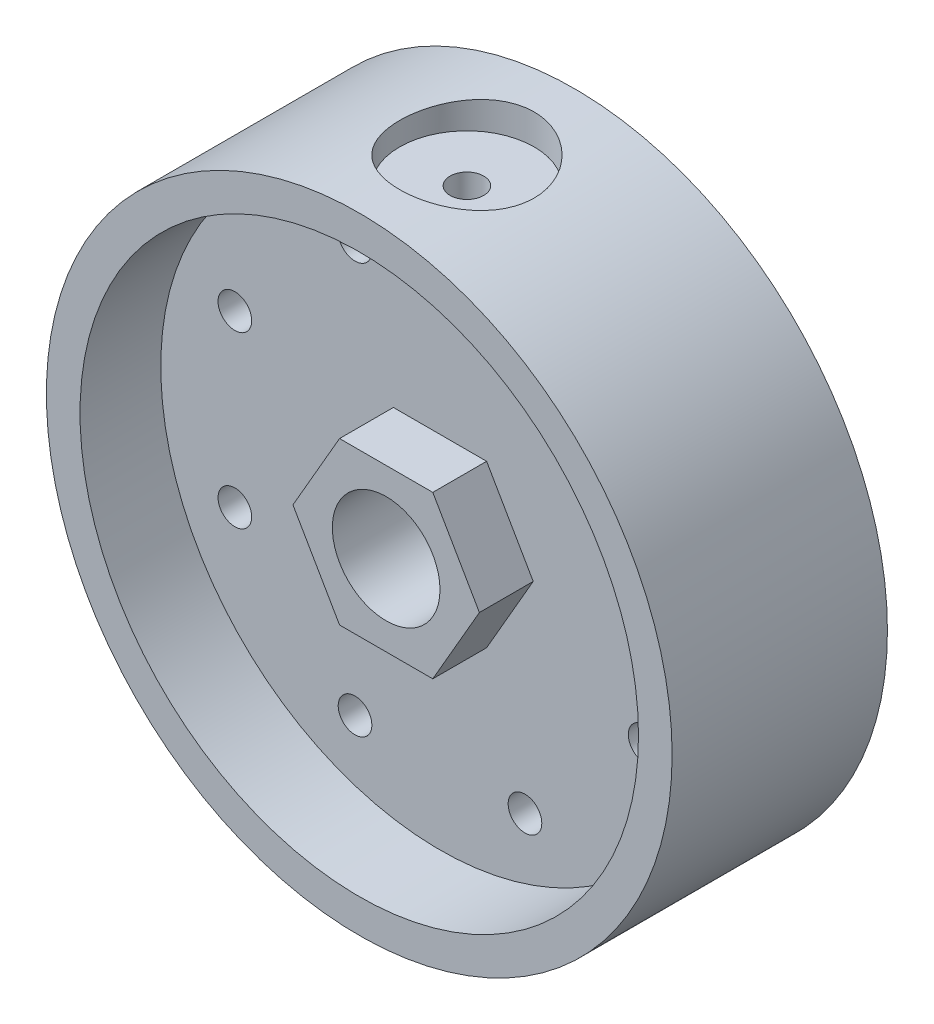
ISO-10303-21;
HEADER;
FILE_DESCRIPTION(('STEP AP214'),'2;1');
FILE_NAME('part.step','',(''),(''),'','','');
FILE_SCHEMA(('AUTOMOTIVE_DESIGN { 1 0 10303 214 1 1 1 1 }'));
ENDSEC;
DATA;
#1=APPLICATION_CONTEXT('core data for automotive mechanical design processes');
#2=APPLICATION_PROTOCOL_DEFINITION('international standard','automotive_design',2000,#1);
#3=PRODUCT_CONTEXT('',#1,'mechanical');
#4=PRODUCT('Part','Part','',(#3));
#5=PRODUCT_RELATED_PRODUCT_CATEGORY('part','',(#4));
#6=PRODUCT_DEFINITION_FORMATION('','',#4);
#7=PRODUCT_DEFINITION_CONTEXT('part definition',#1,'design');
#8=PRODUCT_DEFINITION('design','',#6,#7);
#9=PRODUCT_DEFINITION_SHAPE('','',#8);
#10=(LENGTH_UNIT() NAMED_UNIT(*) SI_UNIT(.MILLI.,.METRE.));
#11=(NAMED_UNIT(*) PLANE_ANGLE_UNIT() SI_UNIT($,.RADIAN.));
#12=(NAMED_UNIT(*) SI_UNIT($,.STERADIAN.) SOLID_ANGLE_UNIT());
#13=UNCERTAINTY_MEASURE_WITH_UNIT(LENGTH_MEASURE(1.E-05),#10,'distance_accuracy_value','');
#14=(GEOMETRIC_REPRESENTATION_CONTEXT(3) GLOBAL_UNCERTAINTY_ASSIGNED_CONTEXT((#13)) GLOBAL_UNIT_ASSIGNED_CONTEXT((#10,
#11,#12)) REPRESENTATION_CONTEXT('',''));
#15=CARTESIAN_POINT('',(0.,0.,0.));
#16=DIRECTION('',(0.,0.,1.));
#17=DIRECTION('',(1.,0.,0.));
#18=AXIS2_PLACEMENT_3D('',#15,#16,#17);
#19=CARTESIAN_POINT('',(0.,0.,8.));
#20=DIRECTION('',(0.,0.,-1.));
#21=DIRECTION('',(-1.,0.,0.));
#22=AXIS2_PLACEMENT_3D('',#19,#20,#21);
#23=CYLINDRICAL_SURFACE('',#22,23.25);
#24=CARTESIAN_POINT('',(0.,0.,-8.));
#25=DIRECTION('',(0.,0.,1.));
#26=DIRECTION('',(1.,0.,0.));
#27=AXIS2_PLACEMENT_3D('',#24,#25,#26);
#28=CIRCLE('',#27,23.25);
#29=CARTESIAN_POINT('',(23.25,0.,-8.));
#30=VERTEX_POINT('',#29);
#31=EDGE_CURVE('E122',#30,#30,#28,.T.);
#32=ORIENTED_EDGE('',*,*,#31,.T.);
#33=EDGE_LOOP('',(#32));
#34=FACE_BOUND('',#33,.T.);
#35=CARTESIAN_POINT('',(0.,0.,8.));
#36=DIRECTION('',(0.,0.,1.));
#37=DIRECTION('',(1.,0.,0.));
#38=AXIS2_PLACEMENT_3D('',#35,#36,#37);
#39=CIRCLE('',#38,23.25);
#40=CARTESIAN_POINT('',(23.25,0.,8.));
#41=VERTEX_POINT('',#40);
#42=EDGE_CURVE('E125',#41,#41,#39,.T.);
#43=ORIENTED_EDGE('',*,*,#42,.F.);
#44=EDGE_LOOP('',(#43));
#45=FACE_BOUND('',#44,.T.);
#46=CARTESIAN_POINT('',(0.,23.25,-5.));
#47=CARTESIAN_POINT('',(-0.277428962297859,23.2499948702913,-4.99999036768172));
#48=CARTESIAN_POINT('',(-0.554975379928546,23.2449838360012,-4.97683198256252));
#49=CARTESIAN_POINT('',(-1.10219239678642,23.2254776982743,-4.88490189615273));
#50=CARTESIAN_POINT('',(-1.37185709013371,23.2109756642638,-4.81609686199501));
#51=CARTESIAN_POINT('',(-1.89532244135633,23.1741031641389,-4.63512200176183));
#52=CARTESIAN_POINT('',(-2.14913908343721,23.1517407819554,-4.52299671645166));
#53=CARTESIAN_POINT('',(-2.63434678045265,23.1015646457361,-4.25870374465413));
#54=CARTESIAN_POINT('',(-2.86573856682339,23.0737510695925,-4.10653736479733));
#55=CARTESIAN_POINT('',(-3.30313494307527,23.0152390562648,-3.76397813617172));
#56=CARTESIAN_POINT('',(-3.50874106944982,22.9845058353873,-3.5730824057878));
#57=CARTESIAN_POINT('',(-3.88527564416666,22.9238650449716,-3.15956319904802));
#58=CARTESIAN_POINT('',(-4.05620108168123,22.8939575473136,-2.93693697084118));
#59=CARTESIAN_POINT('',(-4.36026781740796,22.838012186754,-2.46334633714929));
#60=CARTESIAN_POINT('',(-4.49298727048901,22.8120189338748,-2.21210534828567));
#61=CARTESIAN_POINT('',(-4.71416939687226,22.7673433500252,-1.69023575779506));
#62=CARTESIAN_POINT('',(-4.80263717302081,22.7486601761531,-1.41960939569306));
#63=CARTESIAN_POINT('',(-4.93149249119248,22.7210739264795,-0.870966519756432));
#64=CARTESIAN_POINT('',(-4.97258425004153,22.7120277605787,-0.593122746797123));
#65=CARTESIAN_POINT('',(-5.00771029908521,22.7043098362257,-0.0343489394789598));
#66=CARTESIAN_POINT('',(-5.0017501742957,22.7056368464867,0.246580724634423));
#67=CARTESIAN_POINT('',(-4.94350889212871,22.7183856962227,0.798333440001639));
#68=CARTESIAN_POINT('',(-4.892043603114,22.7296297232994,1.06924734092294));
#69=CARTESIAN_POINT('',(-4.74554451912709,22.760664794592,1.59850361961339));
#70=CARTESIAN_POINT('',(-4.65050835298066,22.7804563039678,1.85684531234289));
#71=CARTESIAN_POINT('',(-4.41881007356435,22.8265328860815,2.35592905727647));
#72=CARTESIAN_POINT('',(-4.28183229486579,22.8528669060609,2.5965198558037));
#73=CARTESIAN_POINT('',(-3.97036119622978,22.9090310288158,3.05160395578765));
#74=CARTESIAN_POINT('',(-3.79586292405064,22.9388615928552,3.26609380638398));
#75=CARTESIAN_POINT('',(-3.40997537731658,22.9994220826484,3.66758681821104));
#76=CARTESIAN_POINT('',(-3.19789181103427,23.030157780725,3.85392244140822));
#77=CARTESIAN_POINT('',(-2.74514086994692,23.0884974747145,4.18848780383638));
#78=CARTESIAN_POINT('',(-2.50447301037253,23.1161014174996,4.33671689667267));
#79=CARTESIAN_POINT('',(-2.00058525498588,23.1651523463971,4.59101799439453));
#80=CARTESIAN_POINT('',(-1.73732106818765,23.1865868647515,4.69700479595844));
#81=CARTESIAN_POINT('',(-1.19615725626832,23.2207908349017,4.86305299295469));
#82=CARTESIAN_POINT('',(-0.918259692829424,23.2335615038378,4.92312083945782));
#83=CARTESIAN_POINT('',(-0.361445668644593,23.2488263800472,4.99466034396225));
#84=CARTESIAN_POINT('',(-0.0826515417727663,23.2515134610579,5.00704419884536));
#85=CARTESIAN_POINT('',(0.47302183264907,23.2468479190746,4.98533344800251));
#86=CARTESIAN_POINT('',(0.749901204339466,23.2394959531988,4.95124188438242));
#87=CARTESIAN_POINT('',(1.29087921493399,23.2156999050576,4.83830476045499));
#88=CARTESIAN_POINT('',(1.55508193359298,23.1993526434246,4.75993554520831));
#89=CARTESIAN_POINT('',(2.06659299096856,23.1593948673067,4.56119479095134));
#90=CARTESIAN_POINT('',(2.31389992178722,23.1357837484367,4.44081975675824));
#91=CARTESIAN_POINT('',(2.78838649710608,23.0834404543401,4.15956906057808));
#92=CARTESIAN_POINT('',(3.01523939947769,23.0546417922087,3.99815481153425));
#93=CARTESIAN_POINT('',(3.43896614383763,22.9952575653828,3.64011926113557));
#94=CARTESIAN_POINT('',(3.63583622519762,22.9646717772008,3.44349355006287));
#95=CARTESIAN_POINT('',(3.99759808824279,22.9044975395541,3.01643712924636));
#96=CARTESIAN_POINT('',(4.16185926930961,22.874936480588,2.78546766990698));
#97=CARTESIAN_POINT('',(4.4492619206881,22.8207809545006,2.29868337547493));
#98=CARTESIAN_POINT('',(4.57240514867625,22.7961862750983,2.04286960301014));
#99=CARTESIAN_POINT('',(4.77325913813275,22.7549779093861,1.51501765096934));
#100=CARTESIAN_POINT('',(4.85122198489893,22.7383200340188,1.24307901170061));
#101=CARTESIAN_POINT('',(4.96024643532958,22.7147886321787,0.689558421167692));
#102=CARTESIAN_POINT('',(4.9913152527825,22.7079136008037,0.407977959938381));
#103=CARTESIAN_POINT('',(5.00537069532063,22.7048188727802,-0.150480745867452));
#104=CARTESIAN_POINT('',(4.98935643314884,22.7083777616307,-0.427333088453452));
#105=CARTESIAN_POINT('',(4.91192811423622,22.7252503601949,-0.974296074952696));
#106=CARTESIAN_POINT('',(4.8505145560264,22.7385639627918,-1.24440679286225));
#107=CARTESIAN_POINT('',(4.68450632201442,22.7733397258809,-1.76945742964018));
#108=CARTESIAN_POINT('',(4.58005242650581,22.7947753020539,-2.02444373682887));
#109=CARTESIAN_POINT('',(4.33105127589723,22.843391081748,-2.51342259096987));
#110=CARTESIAN_POINT('',(4.18650000516138,22.8705718605695,-2.74741303213922));
#111=CARTESIAN_POINT('',(3.85807353516054,22.9282801335397,-3.19269346680374));
#112=CARTESIAN_POINT('',(3.67348434315571,22.9588626984603,-3.40344980173078));
#113=CARTESIAN_POINT('',(3.27167445389198,23.0195536427537,-3.79132394643614));
#114=CARTESIAN_POINT('',(3.054446236119,23.0496619110706,-3.96843398225739));
#115=CARTESIAN_POINT('',(2.59026709005626,23.1064559757312,-4.28609348712874));
#116=CARTESIAN_POINT('',(2.34297979936272,23.1330944979172,-4.42616034893186));
#117=CARTESIAN_POINT('',(1.82785591431367,23.1794753930921,-4.66252105375056));
#118=CARTESIAN_POINT('',(1.56003704553169,23.1992236346963,-4.75885216871198));
#119=CARTESIAN_POINT('',(1.07656677844214,23.2260113490237,-4.88753455682198));
#120=CARTESIAN_POINT('',(0.863560203020742,23.2349520047982,-4.92962971802043));
#121=CARTESIAN_POINT('',(0.433726243381898,23.246948213214,-4.98586562393569));
#122=CARTESIAN_POINT('',(0.216899018374156,23.2500040104998,-5.00000753072196));
#123=CARTESIAN_POINT('',(0.,23.25,-5.));
#124=B_SPLINE_CURVE_WITH_KNOTS('',3,(#46,#47,#48,#49,#50,#51,#52,#53,#54,#55,#56,#57,#58,#59,
#60,#61,#62,#63,#64,#65,#66,#67,#68,#69,#70,#71,#72,#73,#74,#75,#76,#77,#78,#79,#80,#81,#82,#83,
#84,#85,#86,#87,#88,#89,#90,#91,#92,#93,#94,#95,#96,#97,#98,#99,#100,#101,#102,#103,#104,#105,
#106,#107,#108,#109,#110,#111,#112,#113,#114,#115,#116,#117,#118,#119,#120,#121,#122,#123),
.UNSPECIFIED.,.T.,.F.,(4,2,2,2,2,2,2,2,2,2,2,2,2,2,2,2,2,2,2,2,2,2,2,2,2,2,2,2,2,2,2,2,2,2,2,2,
2,2,4),(0.,0.831493043270543,1.66359394276181,2.49484156462187,3.32606206437389,
4.16885936273626,5.01172979784518,5.86357796809005,6.71532788549306,7.55424682366124,
8.39306618441069,9.21714446219887,10.0412675925421,10.8717524839221,11.7023470564088,
12.5502868109724,13.3982409480468,14.2478968690184,15.0974334014212,15.9306350928739,
16.7637822487005,17.5881324481783,18.4125512558161,19.2484047684037,20.084363032651,
20.9351801358292,21.7859608643194,22.6319477612816,23.4778045053694,24.3058424152785,
25.1338712326142,25.9592128897016,26.7846372322227,27.6262098435189,28.4679766637993,
29.320222981575,30.1717416387674,30.8218450790726,31.4719214927842),.UNSPECIFIED.);
#125=CARTESIAN_POINT('',(0.,23.25,-5.));
#126=VERTEX_POINT('',#125);
#127=EDGE_CURVE('E11',#126,#126,#124,.T.);
#128=ORIENTED_EDGE('',*,*,#127,.F.);
#129=EDGE_LOOP('',(#128));
#130=FACE_BOUND('',#129,.T.);
#131=ADVANCED_FACE('F35',(#34,#45,#130),#23,.T.);
#132=CARTESIAN_POINT('',(0.,23.25,0.));
#133=DIRECTION('',(0.,-1.,0.));
#134=DIRECTION('',(0.,0.,-1.));
#135=AXIS2_PLACEMENT_3D('',#132,#133,#134);
#136=CYLINDRICAL_SURFACE('',#135,1.25);
#137=CARTESIAN_POINT('',(0.,4.,-1.25));
#138=CARTESIAN_POINT('',(0.0684391851745465,3.99999965877989,-1.24999955341242));
#139=CARTESIAN_POINT('',(0.136883052502859,3.99822694984841,-1.24436077305555));
#140=CARTESIAN_POINT('',(0.271769209588448,3.99132894088807,-1.22201375846076));
#141=CARTESIAN_POINT('',(0.338211042725907,3.9862028819986,-1.20530301863564));
#142=CARTESIAN_POINT('',(0.467128543650807,3.97315815697909,-1.16143062880426));
#143=CARTESIAN_POINT('',(0.529610176985804,3.96524381499025,-1.13428515534703));
#144=CARTESIAN_POINT('',(0.64913480234646,3.94743969161093,-1.07038268232167));
#145=CARTESIAN_POINT('',(0.706176935444885,3.93754959899905,-1.03362416821941));
#146=CARTESIAN_POINT('',(0.814965334952281,3.91650213740282,-0.950344007982641));
#147=CARTESIAN_POINT('',(0.86652002815666,3.90531715926989,-0.903579114938928));
#148=CARTESIAN_POINT('',(0.961197382036994,3.88310046374208,-0.80213160758645));
#149=CARTESIAN_POINT('',(1.0043184728987,3.87206877523457,-0.747447522505453));
#150=CARTESIAN_POINT('',(1.08194336483114,3.85111144698172,-0.630055436191916));
#151=CARTESIAN_POINT('',(1.11620784150129,3.84121988301796,-0.567182522472778));
#152=CARTESIAN_POINT('',(1.17359741076672,3.82407801799234,-0.436207685018127));
#153=CARTESIAN_POINT('',(1.19672543771945,3.81682702128689,-0.368107144206068));
#154=CARTESIAN_POINT('',(1.23048459930033,3.80607606984501,-0.230771922547938));
#155=CARTESIAN_POINT('',(1.24147110007865,3.80246972929508,-0.161633156361147));
#156=CARTESIAN_POINT('',(1.25174555036988,3.7991005514095,-0.0224068810881062));
#157=CARTESIAN_POINT('',(1.25103660995772,3.79933669227334,0.0476803708216619));
#158=CARTESIAN_POINT('',(1.23821824732739,3.80353189075438,0.183874460268984));
#159=CARTESIAN_POINT('',(1.22656057869383,3.80734341745949,0.250029125861565));
#160=CARTESIAN_POINT('',(1.19290813355626,3.81802025652489,0.379392156537346));
#161=CARTESIAN_POINT('',(1.1709122584455,3.82488589343115,0.4426002077088));
#162=CARTESIAN_POINT('',(1.11688874681277,3.84101044014297,0.565351944432636));
#163=CARTESIAN_POINT('',(1.08471925662082,3.85030284660824,0.624828610691984));
#164=CARTESIAN_POINT('',(1.01136020737848,3.8702185658007,0.737687767879125));
#165=CARTESIAN_POINT('',(0.970168305215772,3.88084222394551,0.791068670253713));
#166=CARTESIAN_POINT('',(0.877716954182123,3.90281527800493,0.892774943416989));
#167=CARTESIAN_POINT('',(0.826084570592817,3.91417569605696,0.940759557779684));
#168=CARTESIAN_POINT('',(0.71536440809553,3.9359157075958,1.02747189357968));
#169=CARTESIAN_POINT('',(0.65627607734902,3.94629522838372,1.06619892921921));
#170=CARTESIAN_POINT('',(0.531664610465454,3.96501294890191,1.13352768860128));
#171=CARTESIAN_POINT('',(0.466094906919279,3.97333460648208,1.16204813546397));
#172=CARTESIAN_POINT('',(0.330767977782644,3.98687955828554,1.20755300085157));
#173=CARTESIAN_POINT('',(0.261012030724608,3.99210379325151,1.2245409222384));
#174=CARTESIAN_POINT('',(0.122185157290344,3.99871389395014,1.24591804257898));
#175=CARTESIAN_POINT('',(0.0531918487888419,4.00024022895439,1.25076854359352));
#176=CARTESIAN_POINT('',(-0.0846303057325852,3.99969799730981,1.24903377336267));
#177=CARTESIAN_POINT('',(-0.153459174306506,3.99762995581125,1.2424501726774));
#178=CARTESIAN_POINT('',(-0.287219332975852,3.99022363769772,1.21840440739361));
#179=CARTESIAN_POINT('',(-0.352204978420948,3.98496793110725,1.20121673238748));
#180=CARTESIAN_POINT('',(-0.478351928861365,3.97180121379252,1.15678564763331));
#181=CARTESIAN_POINT('',(-0.539512760449016,3.96388987514203,1.12954099597509));
#182=CARTESIAN_POINT('',(-0.657932406672232,3.94598542759568,1.06502678345121));
#183=CARTESIAN_POINT('',(-0.715059739787955,3.9359462681821,1.02752901250278));
#184=CARTESIAN_POINT('',(-0.822365850960095,3.91493410002887,0.943846789882984));
#185=CARTESIAN_POINT('',(-0.872542738043336,3.90396083845862,0.897659982256886));
#186=CARTESIAN_POINT('',(-0.966587462919657,3.88176994885247,0.795741109946314));
#187=CARTESIAN_POINT('',(-1.01012652339774,3.87055986714446,0.739703336254742));
#188=CARTESIAN_POINT('',(-1.08721250244909,3.84961947087602,0.620873383629261));
#189=CARTESIAN_POINT('',(-1.12075957972524,3.839889132814,0.558081311995568));
#190=CARTESIAN_POINT('',(-1.17670083481141,3.82311782360754,0.427654827114141));
#191=CARTESIAN_POINT('',(-1.19913819558886,3.81606646468027,0.360040350495301));
#192=CARTESIAN_POINT('',(-1.23222894320964,3.80551170941212,0.221727506676204));
#193=CARTESIAN_POINT('',(-1.2428868141461,3.80200696302675,0.151030323628686));
#194=CARTESIAN_POINT('',(-1.2517940615754,3.79908292712494,0.0119959124457574));
#195=CARTESIAN_POINT('',(-1.25058279621957,3.79948604683077,-0.056303453812931));
#196=CARTESIAN_POINT('',(-1.23708818129474,3.80390090472383,-0.19167458491918));
#197=CARTESIAN_POINT('',(-1.22480534822559,3.80791247457319,-0.258746406884));
#198=CARTESIAN_POINT('',(-1.18987729913378,3.81896814158112,-0.388794039601782));
#199=CARTESIAN_POINT('',(-1.16738642405944,3.82596698183474,-0.451815441096014));
#200=CARTESIAN_POINT('',(-1.11280227335064,3.84219704261348,-0.573240413531351));
#201=CARTESIAN_POINT('',(-1.08070704444254,3.85142871716522,-0.631643042077681));
#202=CARTESIAN_POINT('',(-1.00635675013475,3.8715348703158,-0.744645970440566));
#203=CARTESIAN_POINT('',(-0.963753335241274,3.88245948922441,-0.799008129500441));
#204=CARTESIAN_POINT('',(-0.870208996404848,3.90448998821726,-0.899986328111797));
#205=CARTESIAN_POINT('',(-0.819265842344402,3.91559591606795,-0.946600288991005));
#206=CARTESIAN_POINT('',(-0.708486662823332,3.93717271952329,-1.03228253836299));
#207=CARTESIAN_POINT('',(-0.64841457448738,3.94761101730634,-1.07105473644997));
#208=CARTESIAN_POINT('',(-0.522279138013654,3.96626769296916,-1.13789891513944));
#209=CARTESIAN_POINT('',(-0.456218157795449,3.97448694315832,-1.16597510214183));
#210=CARTESIAN_POINT('',(-0.325747635373977,3.98720650733461,-1.20859136760847));
#211=CARTESIAN_POINT('',(-0.261670337112545,3.99196240806139,-1.22407486730534));
#212=CARTESIAN_POINT('',(-0.131729895440247,3.99835900340486,-1.24477835996771));
#213=CARTESIAN_POINT('',(-0.0658671161396747,4.00000032839644,-1.250000429804));
#214=CARTESIAN_POINT('',(0.,4.,-1.25));
#215=B_SPLINE_CURVE_WITH_KNOTS('',3,(#137,#138,#139,#140,#141,#142,#143,#144,#145,#146,#147,
#148,#149,#150,#151,#152,#153,#154,#155,#156,#157,#158,#159,#160,#161,#162,#163,#164,#165,#166,
#167,#168,#169,#170,#171,#172,#173,#174,#175,#176,#177,#178,#179,#180,#181,#182,#183,#184,#185,
#186,#187,#188,#189,#190,#191,#192,#193,#194,#195,#196,#197,#198,#199,#200,#201,#202,#203,#204,
#205,#206,#207,#208,#209,#210,#211,#212,#213,#214),.UNSPECIFIED.,.T.,.F.,(4,2,2,2,2,2,2,2,2,2,2,
2,2,2,2,2,2,2,2,2,2,2,2,2,2,2,2,2,2,2,2,2,2,2,2,2,2,2,4),(0.,0.20507544943251,0.410197323349066,
0.615002479202436,0.819839921558391,1.03037822195158,1.24095567431276,1.45673771247494,
1.67246286279527,1.8816915016721,2.09086450295138,2.29176917422169,2.49269519979063,
2.69655642720545,2.90047066010359,3.113667472796,3.32688007413303,3.5417546068977,
3.75656384494554,3.96307568548237,4.16955735649363,4.37090626722872,4.572280050345,
4.77856324738343,4.98490245709259,5.1994177871314,5.41392970983712,5.62760115751031,
5.84119123892431,6.04512203476054,6.24904331751085,6.44997913396672,6.65095584330174,
6.85979514006362,7.06869037373341,7.28440668126413,7.50003806666338,7.69744636651541,
7.89481470763048),.UNSPECIFIED.);
#216=CARTESIAN_POINT('',(0.,4.,-1.25));
#217=VERTEX_POINT('',#216);
#218=EDGE_CURVE('E148',#217,#217,#215,.T.);
#219=ORIENTED_EDGE('',*,*,#218,.T.);
#220=EDGE_LOOP('',(#219));
#221=FACE_BOUND('',#220,.T.);
#222=CARTESIAN_POINT('',(0.,21.,0.));
#223=DIRECTION('',(0.,1.,0.));
#224=DIRECTION('',(0.,0.,1.));
#225=AXIS2_PLACEMENT_3D('',#222,#223,#224);
#226=CIRCLE('',#225,1.25);
#227=CARTESIAN_POINT('',(0.,21.,1.25));
#228=VERTEX_POINT('',#227);
#229=EDGE_CURVE('E156',#228,#228,#226,.T.);
#230=ORIENTED_EDGE('',*,*,#229,.T.);
#231=EDGE_LOOP('',(#230));
#232=FACE_BOUND('',#231,.T.);
#233=ADVANCED_FACE('F160',(#221,#232),#136,.F.);
#234=CARTESIAN_POINT('',(0.,0.,-6.));
#235=DIRECTION('',(0.,0.,1.));
#236=DIRECTION('',(1.,0.,0.));
#237=AXIS2_PLACEMENT_3D('',#234,#235,#236);
#238=CYLINDRICAL_SURFACE('',#237,4.);
#239=CARTESIAN_POINT('',(0.,0.,6.));
#240=DIRECTION('',(0.,0.,1.));
#241=DIRECTION('',(1.,0.,0.));
#242=AXIS2_PLACEMENT_3D('',#239,#240,#241);
#243=CIRCLE('',#242,4.);
#244=CARTESIAN_POINT('',(4.,0.,6.));
#245=VERTEX_POINT('',#244);
#246=EDGE_CURVE('E155',#245,#245,#243,.T.);
#247=ORIENTED_EDGE('',*,*,#246,.T.);
#248=EDGE_LOOP('',(#247));
#249=FACE_BOUND('',#248,.T.);
#250=CARTESIAN_POINT('',(0.,0.,-2.));
#251=DIRECTION('',(0.,0.,1.));
#252=DIRECTION('',(1.,0.,0.));
#253=AXIS2_PLACEMENT_3D('',#250,#251,#252);
#254=CIRCLE('',#253,4.);
#255=CARTESIAN_POINT('',(4.,0.,-2.));
#256=VERTEX_POINT('',#255);
#257=EDGE_CURVE('E107',#256,#256,#254,.T.);
#258=ORIENTED_EDGE('',*,*,#257,.F.);
#259=EDGE_LOOP('',(#258));
#260=FACE_BOUND('',#259,.T.);
#261=ORIENTED_EDGE('',*,*,#218,.F.);
#262=EDGE_LOOP('',(#261));
#263=FACE_BOUND('',#262,.T.);
#264=ADVANCED_FACE('F157',(#249,#260,#263),#238,.F.);
#265=CARTESIAN_POINT('',(0.,0.,2.));
#266=DIRECTION('',(0.,0.,1.));
#267=DIRECTION('',(1.,0.,0.));
#268=AXIS2_PLACEMENT_3D('',#265,#266,#267);
#269=PLANE('',#268);
#270=CARTESIAN_POINT('',(6.31427663402378,15.2440122864363,2.));
#271=DIRECTION('',(0.,0.,1.));
#272=DIRECTION('',(1.,0.,0.));
#273=AXIS2_PLACEMENT_3D('',#270,#271,#272);
#274=CIRCLE('',#273,1.25);
#275=CARTESIAN_POINT('',(7.56427663402378,15.2440122864363,2.));
#276=VERTEX_POINT('',#275);
#277=EDGE_CURVE('E183',#276,#276,#274,.T.);
#278=ORIENTED_EDGE('',*,*,#277,.F.);
#279=EDGE_LOOP('',(#278));
#280=FACE_BOUND('',#279,.T.);
#281=CARTESIAN_POINT('',(15.2440122864362,6.31427663402416,2.));
#282=DIRECTION('',(0.,0.,1.));
#283=DIRECTION('',(1.,0.,0.));
#284=AXIS2_PLACEMENT_3D('',#281,#282,#283);
#285=CIRCLE('',#284,1.25);
#286=CARTESIAN_POINT('',(16.4940122864362,6.31427663402416,2.));
#287=VERTEX_POINT('',#286);
#288=EDGE_CURVE('E201',#287,#287,#285,.T.);
#289=ORIENTED_EDGE('',*,*,#288,.F.);
#290=EDGE_LOOP('',(#289));
#291=FACE_BOUND('',#290,.T.);
#292=CARTESIAN_POINT('',(15.2440122864363,-6.31427663402384,2.));
#293=DIRECTION('',(0.,0.,1.));
#294=DIRECTION('',(1.,0.,0.));
#295=AXIS2_PLACEMENT_3D('',#292,#293,#294);
#296=CIRCLE('',#295,1.25);
#297=CARTESIAN_POINT('',(16.4940122864363,-6.31427663402384,2.));
#298=VERTEX_POINT('',#297);
#299=EDGE_CURVE('E198',#298,#298,#296,.T.);
#300=ORIENTED_EDGE('',*,*,#299,.F.);
#301=EDGE_LOOP('',(#300));
#302=FACE_BOUND('',#301,.T.);
#303=CARTESIAN_POINT('',(6.314276634024,-15.2440122864362,2.));
#304=DIRECTION('',(0.,0.,1.));
#305=DIRECTION('',(1.,0.,0.));
#306=AXIS2_PLACEMENT_3D('',#303,#304,#305);
#307=CIRCLE('',#306,1.25);
#308=CARTESIAN_POINT('',(7.564276634024,-15.2440122864362,2.));
#309=VERTEX_POINT('',#308);
#310=EDGE_CURVE('E195',#309,#309,#307,.T.);
#311=ORIENTED_EDGE('',*,*,#310,.F.);
#312=EDGE_LOOP('',(#311));
#313=FACE_BOUND('',#312,.T.);
#314=CARTESIAN_POINT('',(-6.31427663402389,-15.2440122864363,2.));
#315=DIRECTION('',(0.,0.,1.));
#316=DIRECTION('',(1.,0.,0.));
#317=AXIS2_PLACEMENT_3D('',#314,#315,#316);
#318=CIRCLE('',#317,1.25);
#319=CARTESIAN_POINT('',(-5.06427663402389,-15.2440122864363,2.));
#320=VERTEX_POINT('',#319);
#321=EDGE_CURVE('E191',#320,#320,#318,.T.);
#322=ORIENTED_EDGE('',*,*,#321,.F.);
#323=EDGE_LOOP('',(#322));
#324=FACE_BOUND('',#323,.T.);
#325=CARTESIAN_POINT('',(-15.2440122864362,-6.31427663402405,2.));
#326=DIRECTION('',(0.,0.,1.));
#327=DIRECTION('',(1.,0.,0.));
#328=AXIS2_PLACEMENT_3D('',#325,#326,#327);
#329=CIRCLE('',#328,1.25);
#330=CARTESIAN_POINT('',(-13.9940122864362,-6.31427663402405,2.));
#331=VERTEX_POINT('',#330);
#332=EDGE_CURVE('E187',#331,#331,#329,.T.);
#333=ORIENTED_EDGE('',*,*,#332,.F.);
#334=EDGE_LOOP('',(#333));
#335=FACE_BOUND('',#334,.T.);
#336=CARTESIAN_POINT('',(-15.2440122864363,6.31427663402394,2.));
#337=DIRECTION('',(0.,0.,1.));
#338=DIRECTION('',(1.,0.,0.));
#339=AXIS2_PLACEMENT_3D('',#336,#337,#338);
#340=CIRCLE('',#339,1.25);
#341=CARTESIAN_POINT('',(-13.9940122864363,6.31427663402394,2.));
#342=VERTEX_POINT('',#341);
#343=EDGE_CURVE('E179',#342,#342,#340,.T.);
#344=ORIENTED_EDGE('',*,*,#343,.F.);
#345=EDGE_LOOP('',(#344));
#346=FACE_BOUND('',#345,.T.);
#347=CARTESIAN_POINT('',(-6.314276634024,15.2440122864362,2.));
#348=DIRECTION('',(0.,0.,1.));
#349=DIRECTION('',(1.,0.,0.));
#350=AXIS2_PLACEMENT_3D('',#347,#348,#349);
#351=CIRCLE('',#350,1.25);
#352=CARTESIAN_POINT('',(-5.064276634024,15.2440122864362,2.));
#353=VERTEX_POINT('',#352);
#354=EDGE_CURVE('E178',#353,#353,#351,.T.);
#355=ORIENTED_EDGE('',*,*,#354,.F.);
#356=EDGE_LOOP('',(#355));
#357=FACE_BOUND('',#356,.T.);
#358=CARTESIAN_POINT('',(0.,0.,2.));
#359=DIRECTION('',(0.,0.,1.));
#360=DIRECTION('',(1.,0.,0.));
#361=AXIS2_PLACEMENT_3D('',#358,#359,#360);
#362=CIRCLE('',#361,20.75);
#363=CARTESIAN_POINT('',(20.75,0.,2.));
#364=VERTEX_POINT('',#363);
#365=EDGE_CURVE('E128',#364,#364,#362,.T.);
#366=ORIENTED_EDGE('',*,*,#365,.T.);
#367=EDGE_LOOP('',(#366));
#368=FACE_BOUND('',#367,.T.);
#369=DIRECTION('',(0.5,0.866025403784439,0.));
#370=VECTOR('',#369,1.);
#371=CARTESIAN_POINT('',(-5.19615242270663,3.,2.));
#372=LINE('',#371,#370);
#373=CARTESIAN_POINT('',(-6.92820323027551,0.,2.));
#374=VERTEX_POINT('',#373);
#375=CARTESIAN_POINT('',(-3.46410161513776,6.,2.));
#376=VERTEX_POINT('',#375);
#377=EDGE_CURVE('E145',#374,#376,#372,.T.);
#378=ORIENTED_EDGE('',*,*,#377,.T.);
#379=DIRECTION('',(1.,0.,0.));
#380=VECTOR('',#379,1.);
#381=CARTESIAN_POINT('',(0.,6.,2.));
#382=LINE('',#381,#380);
#383=CARTESIAN_POINT('',(3.46410161513776,6.,2.));
#384=VERTEX_POINT('',#383);
#385=EDGE_CURVE('E44',#376,#384,#382,.T.);
#386=ORIENTED_EDGE('',*,*,#385,.T.);
#387=DIRECTION('',(0.5,-0.866025403784439,0.));
#388=VECTOR('',#387,1.);
#389=CARTESIAN_POINT('',(5.19615242270663,3.,2.));
#390=LINE('',#389,#388);
#391=CARTESIAN_POINT('',(6.92820323027551,0.,2.));
#392=VERTEX_POINT('',#391);
#393=EDGE_CURVE('E133',#384,#392,#390,.T.);
#394=ORIENTED_EDGE('',*,*,#393,.T.);
#395=DIRECTION('',(-0.5,-0.866025403784439,0.));
#396=VECTOR('',#395,1.);
#397=CARTESIAN_POINT('',(5.19615242270663,-3.,2.));
#398=LINE('',#397,#396);
#399=CARTESIAN_POINT('',(3.46410161513776,-6.,2.));
#400=VERTEX_POINT('',#399);
#401=EDGE_CURVE('E136',#392,#400,#398,.T.);
#402=ORIENTED_EDGE('',*,*,#401,.T.);
#403=DIRECTION('',(-1.,0.,0.));
#404=VECTOR('',#403,1.);
#405=CARTESIAN_POINT('',(0.,-6.,2.));
#406=LINE('',#405,#404);
#407=CARTESIAN_POINT('',(-3.46410161513776,-6.,2.));
#408=VERTEX_POINT('',#407);
#409=EDGE_CURVE('E139',#400,#408,#406,.T.);
#410=ORIENTED_EDGE('',*,*,#409,.T.);
#411=DIRECTION('',(-0.5,0.866025403784439,0.));
#412=VECTOR('',#411,1.);
#413=CARTESIAN_POINT('',(-5.19615242270663,-3.,2.));
#414=LINE('',#413,#412);
#415=EDGE_CURVE('E142',#408,#374,#414,.T.);
#416=ORIENTED_EDGE('',*,*,#415,.T.);
#417=EDGE_LOOP('',(#378,#386,#394,#402,#410,#416));
#418=FACE_BOUND('',#417,.T.);
#419=ADVANCED_FACE('F245',(#280,#291,#302,#313,#324,#335,#346,#357,#368,#418),#269,.T.);
#420=CARTESIAN_POINT('',(0.,0.,8.));
#421=DIRECTION('',(0.,0.,-1.));
#422=DIRECTION('',(-1.,0.,0.));
#423=AXIS2_PLACEMENT_3D('',#420,#421,#422);
#424=CYLINDRICAL_SURFACE('',#423,20.75);
#425=CARTESIAN_POINT('',(0.,0.,-8.));
#426=DIRECTION('',(0.,0.,1.));
#427=DIRECTION('',(1.,0.,0.));
#428=AXIS2_PLACEMENT_3D('',#425,#426,#427);
#429=CIRCLE('',#428,20.75);
#430=CARTESIAN_POINT('',(20.75,0.,-8.));
#431=VERTEX_POINT('',#430);
#432=EDGE_CURVE('E113',#431,#431,#429,.T.);
#433=ORIENTED_EDGE('',*,*,#432,.F.);
#434=EDGE_LOOP('',(#433));
#435=FACE_BOUND('',#434,.T.);
#436=CARTESIAN_POINT('',(0.,0.,-2.));
#437=DIRECTION('',(0.,0.,1.));
#438=DIRECTION('',(1.,0.,0.));
#439=AXIS2_PLACEMENT_3D('',#436,#437,#438);
#440=CIRCLE('',#439,20.75);
#441=CARTESIAN_POINT('',(20.75,0.,-2.));
#442=VERTEX_POINT('',#441);
#443=EDGE_CURVE('E110',#442,#442,#440,.T.);
#444=ORIENTED_EDGE('',*,*,#443,.T.);
#445=EDGE_LOOP('',(#444));
#446=FACE_BOUND('',#445,.T.);
#447=ADVANCED_FACE('F273',(#435,#446),#424,.F.);
#448=CARTESIAN_POINT('',(0.,0.,8.));
#449=DIRECTION('',(0.,0.,1.));
#450=DIRECTION('',(1.,0.,0.));
#451=AXIS2_PLACEMENT_3D('',#448,#449,#450);
#452=PLANE('',#451);
#453=ORIENTED_EDGE('',*,*,#42,.T.);
#454=EDGE_LOOP('',(#453));
#455=FACE_BOUND('',#454,.T.);
#456=CARTESIAN_POINT('',(0.,0.,8.));
#457=DIRECTION('',(0.,0.,1.));
#458=DIRECTION('',(1.,0.,0.));
#459=AXIS2_PLACEMENT_3D('',#456,#457,#458);
#460=CIRCLE('',#459,20.75);
#461=CARTESIAN_POINT('',(20.75,0.,8.));
#462=VERTEX_POINT('',#461);
#463=EDGE_CURVE('E119',#462,#462,#460,.T.);
#464=ORIENTED_EDGE('',*,*,#463,.F.);
#465=EDGE_LOOP('',(#464));
#466=FACE_BOUND('',#465,.T.);
#467=ADVANCED_FACE('F269',(#455,#466),#452,.T.);
#468=CARTESIAN_POINT('',(0.,0.,-8.));
#469=DIRECTION('',(0.,0.,1.));
#470=DIRECTION('',(1.,0.,0.));
#471=AXIS2_PLACEMENT_3D('',#468,#469,#470);
#472=PLANE('',#471);
#473=ORIENTED_EDGE('',*,*,#31,.F.);
#474=EDGE_LOOP('',(#473));
#475=FACE_BOUND('',#474,.T.);
#476=ORIENTED_EDGE('',*,*,#432,.T.);
#477=EDGE_LOOP('',(#476));
#478=FACE_BOUND('',#477,.T.);
#479=ADVANCED_FACE('F272',(#475,#478),#472,.F.);
#480=ORIENTED_EDGE('',*,*,#365,.F.);
#481=EDGE_LOOP('',(#480));
#482=FACE_BOUND('',#481,.T.);
#483=ORIENTED_EDGE('',*,*,#463,.T.);
#484=EDGE_LOOP('',(#483));
#485=FACE_BOUND('',#484,.T.);
#486=ADVANCED_FACE('F277',(#482,#485),#424,.F.);
#487=CARTESIAN_POINT('',(0.,0.,-2.));
#488=DIRECTION('',(0.,0.,1.));
#489=DIRECTION('',(1.,0.,0.));
#490=AXIS2_PLACEMENT_3D('',#487,#488,#489);
#491=PLANE('',#490);
#492=CARTESIAN_POINT('',(6.31427663402378,15.2440122864363,-2.));
#493=DIRECTION('',(0.,0.,1.));
#494=DIRECTION('',(1.,0.,0.));
#495=AXIS2_PLACEMENT_3D('',#492,#493,#494);
#496=CIRCLE('',#495,1.25);
#497=CARTESIAN_POINT('',(7.56427663402378,15.2440122864363,-2.));
#498=VERTEX_POINT('',#497);
#499=EDGE_CURVE('E39',#498,#498,#496,.T.);
#500=ORIENTED_EDGE('',*,*,#499,.T.);
#501=EDGE_LOOP('',(#500));
#502=FACE_BOUND('',#501,.T.);
#503=CARTESIAN_POINT('',(15.2440122864362,6.31427663402416,-2.));
#504=DIRECTION('',(0.,0.,1.));
#505=DIRECTION('',(1.,0.,0.));
#506=AXIS2_PLACEMENT_3D('',#503,#504,#505);
#507=CIRCLE('',#506,1.25);
#508=CARTESIAN_POINT('',(16.4940122864362,6.31427663402416,-2.));
#509=VERTEX_POINT('',#508);
#510=EDGE_CURVE('E199',#509,#509,#507,.T.);
#511=ORIENTED_EDGE('',*,*,#510,.T.);
#512=EDGE_LOOP('',(#511));
#513=FACE_BOUND('',#512,.T.);
#514=CARTESIAN_POINT('',(15.2440122864363,-6.31427663402384,-2.));
#515=DIRECTION('',(0.,0.,1.));
#516=DIRECTION('',(1.,0.,0.));
#517=AXIS2_PLACEMENT_3D('',#514,#515,#516);
#518=CIRCLE('',#517,1.25);
#519=CARTESIAN_POINT('',(16.4940122864363,-6.31427663402384,-2.));
#520=VERTEX_POINT('',#519);
#521=EDGE_CURVE('E196',#520,#520,#518,.T.);
#522=ORIENTED_EDGE('',*,*,#521,.T.);
#523=EDGE_LOOP('',(#522));
#524=FACE_BOUND('',#523,.T.);
#525=CARTESIAN_POINT('',(6.314276634024,-15.2440122864362,-2.));
#526=DIRECTION('',(0.,0.,1.));
#527=DIRECTION('',(1.,0.,0.));
#528=AXIS2_PLACEMENT_3D('',#525,#526,#527);
#529=CIRCLE('',#528,1.25);
#530=CARTESIAN_POINT('',(7.564276634024,-15.2440122864362,-2.));
#531=VERTEX_POINT('',#530);
#532=EDGE_CURVE('E192',#531,#531,#529,.T.);
#533=ORIENTED_EDGE('',*,*,#532,.T.);
#534=EDGE_LOOP('',(#533));
#535=FACE_BOUND('',#534,.T.);
#536=CARTESIAN_POINT('',(-6.31427663402389,-15.2440122864363,-2.));
#537=DIRECTION('',(0.,0.,1.));
#538=DIRECTION('',(1.,0.,0.));
#539=AXIS2_PLACEMENT_3D('',#536,#537,#538);
#540=CIRCLE('',#539,1.25);
#541=CARTESIAN_POINT('',(-5.06427663402389,-15.2440122864363,-2.));
#542=VERTEX_POINT('',#541);
#543=EDGE_CURVE('E188',#542,#542,#540,.T.);
#544=ORIENTED_EDGE('',*,*,#543,.T.);
#545=EDGE_LOOP('',(#544));
#546=FACE_BOUND('',#545,.T.);
#547=CARTESIAN_POINT('',(-15.2440122864362,-6.31427663402405,-2.));
#548=DIRECTION('',(0.,0.,1.));
#549=DIRECTION('',(1.,0.,0.));
#550=AXIS2_PLACEMENT_3D('',#547,#548,#549);
#551=CIRCLE('',#550,1.25);
#552=CARTESIAN_POINT('',(-13.9940122864362,-6.31427663402405,-2.));
#553=VERTEX_POINT('',#552);
#554=EDGE_CURVE('E184',#553,#553,#551,.T.);
#555=ORIENTED_EDGE('',*,*,#554,.T.);
#556=EDGE_LOOP('',(#555));
#557=FACE_BOUND('',#556,.T.);
#558=CARTESIAN_POINT('',(-15.2440122864363,6.31427663402394,-2.));
#559=DIRECTION('',(0.,0.,1.));
#560=DIRECTION('',(1.,0.,0.));
#561=AXIS2_PLACEMENT_3D('',#558,#559,#560);
#562=CIRCLE('',#561,1.25);
#563=CARTESIAN_POINT('',(-13.9940122864363,6.31427663402394,-2.));
#564=VERTEX_POINT('',#563);
#565=EDGE_CURVE('E180',#564,#564,#562,.T.);
#566=ORIENTED_EDGE('',*,*,#565,.T.);
#567=EDGE_LOOP('',(#566));
#568=FACE_BOUND('',#567,.T.);
#569=CARTESIAN_POINT('',(-6.314276634024,15.2440122864362,-2.));
#570=DIRECTION('',(0.,0.,1.));
#571=DIRECTION('',(1.,0.,0.));
#572=AXIS2_PLACEMENT_3D('',#569,#570,#571);
#573=CIRCLE('',#572,1.25);
#574=CARTESIAN_POINT('',(-5.064276634024,15.2440122864362,-2.));
#575=VERTEX_POINT('',#574);
#576=EDGE_CURVE('E175',#575,#575,#573,.T.);
#577=ORIENTED_EDGE('',*,*,#576,.T.);
#578=EDGE_LOOP('',(#577));
#579=FACE_BOUND('',#578,.T.);
#580=ORIENTED_EDGE('',*,*,#257,.T.);
#581=EDGE_LOOP('',(#580));
#582=FACE_BOUND('',#581,.T.);
#583=ORIENTED_EDGE('',*,*,#443,.F.);
#584=EDGE_LOOP('',(#583));
#585=FACE_BOUND('',#584,.T.);
#586=ADVANCED_FACE('F279',(#502,#513,#524,#535,#546,#557,#568,#579,#582,#585),#491,.F.);
#587=CARTESIAN_POINT('',(3.46410161513776,6.,6.));
#588=DIRECTION('',(0.,-1.,0.));
#589=DIRECTION('',(0.,0.,-1.));
#590=AXIS2_PLACEMENT_3D('',#587,#588,#589);
#591=PLANE('',#590);
#592=ORIENTED_EDGE('',*,*,#385,.F.);
#593=DIRECTION('',(0.,0.,-1.));
#594=VECTOR('',#593,1.);
#595=CARTESIAN_POINT('',(-3.46410161513776,6.,6.));
#596=LINE('',#595,#594);
#597=CARTESIAN_POINT('',(-3.46410161513776,6.,6.));
#598=VERTEX_POINT('',#597);
#599=EDGE_CURVE('E94',#598,#376,#596,.T.);
#600=ORIENTED_EDGE('',*,*,#599,.F.);
#601=DIRECTION('',(-1.,0.,0.));
#602=VECTOR('',#601,1.);
#603=CARTESIAN_POINT('',(3.46410161513776,6.,6.));
#604=LINE('',#603,#602);
#605=CARTESIAN_POINT('',(3.46410161513776,6.,6.));
#606=VERTEX_POINT('',#605);
#607=EDGE_CURVE('E101',#606,#598,#604,.T.);
#608=ORIENTED_EDGE('',*,*,#607,.F.);
#609=DIRECTION('',(0.,0.,-1.));
#610=VECTOR('',#609,1.);
#611=CARTESIAN_POINT('',(3.46410161513776,6.,6.));
#612=LINE('',#611,#610);
#613=EDGE_CURVE('E232',#606,#384,#612,.T.);
#614=ORIENTED_EDGE('',*,*,#613,.T.);
#615=EDGE_LOOP('',(#592,#600,#608,#614));
#616=FACE_BOUND('',#615,.T.);
#617=ADVANCED_FACE('F109',(#616),#591,.F.);
#618=CARTESIAN_POINT('',(-3.46410161513776,6.,6.));
#619=DIRECTION('',(0.866025403784439,-0.5,0.));
#620=DIRECTION('',(0.5,0.866025403784439,0.));
#621=AXIS2_PLACEMENT_3D('',#618,#619,#620);
#622=PLANE('',#621);
#623=ORIENTED_EDGE('',*,*,#377,.F.);
#624=DIRECTION('',(0.,0.,-1.));
#625=VECTOR('',#624,1.);
#626=CARTESIAN_POINT('',(-6.92820323027551,0.,6.));
#627=LINE('',#626,#625);
#628=CARTESIAN_POINT('',(-6.92820323027551,0.,6.));
#629=VERTEX_POINT('',#628);
#630=EDGE_CURVE('E97',#629,#374,#627,.T.);
#631=ORIENTED_EDGE('',*,*,#630,.F.);
#632=DIRECTION('',(-0.5,-0.866025403784439,0.));
#633=VECTOR('',#632,1.);
#634=CARTESIAN_POINT('',(-3.46410161513776,6.,6.));
#635=LINE('',#634,#633);
#636=EDGE_CURVE('E91',#598,#629,#635,.T.);
#637=ORIENTED_EDGE('',*,*,#636,.F.);
#638=ORIENTED_EDGE('',*,*,#599,.T.);
#639=EDGE_LOOP('',(#623,#631,#637,#638));
#640=FACE_BOUND('',#639,.T.);
#641=ADVANCED_FACE('F93',(#640),#622,.F.);
#642=CARTESIAN_POINT('',(-6.92820323027551,0.,6.));
#643=DIRECTION('',(0.866025403784439,0.5,0.));
#644=DIRECTION('',(-0.5,0.866025403784439,0.));
#645=AXIS2_PLACEMENT_3D('',#642,#643,#644);
#646=PLANE('',#645);
#647=ORIENTED_EDGE('',*,*,#415,.F.);
#648=DIRECTION('',(0.,0.,-1.));
#649=VECTOR('',#648,1.);
#650=CARTESIAN_POINT('',(-3.46410161513776,-6.,6.));
#651=LINE('',#650,#649);
#652=CARTESIAN_POINT('',(-3.46410161513776,-6.,6.));
#653=VERTEX_POINT('',#652);
#654=EDGE_CURVE('E115',#653,#408,#651,.T.);
#655=ORIENTED_EDGE('',*,*,#654,.F.);
#656=DIRECTION('',(0.5,-0.866025403784439,0.));
#657=VECTOR('',#656,1.);
#658=CARTESIAN_POINT('',(-6.92820323027551,0.,6.));
#659=LINE('',#658,#657);
#660=EDGE_CURVE('E100',#629,#653,#659,.T.);
#661=ORIENTED_EDGE('',*,*,#660,.F.);
#662=ORIENTED_EDGE('',*,*,#630,.T.);
#663=EDGE_LOOP('',(#647,#655,#661,#662));
#664=FACE_BOUND('',#663,.T.);
#665=ADVANCED_FACE('F249',(#664),#646,.F.);
#666=CARTESIAN_POINT('',(-3.46410161513776,-6.,6.));
#667=DIRECTION('',(0.,1.,0.));
#668=DIRECTION('',(0.,0.,1.));
#669=AXIS2_PLACEMENT_3D('',#666,#667,#668);
#670=PLANE('',#669);
#671=ORIENTED_EDGE('',*,*,#409,.F.);
#672=DIRECTION('',(0.,0.,-1.));
#673=VECTOR('',#672,1.);
#674=CARTESIAN_POINT('',(3.46410161513776,-6.,6.));
#675=LINE('',#674,#673);
#676=CARTESIAN_POINT('',(3.46410161513776,-6.,6.));
#677=VERTEX_POINT('',#676);
#678=EDGE_CURVE('E235',#677,#400,#675,.T.);
#679=ORIENTED_EDGE('',*,*,#678,.F.);
#680=DIRECTION('',(1.,0.,0.));
#681=VECTOR('',#680,1.);
#682=CARTESIAN_POINT('',(-3.46410161513776,-6.,6.));
#683=LINE('',#682,#681);
#684=EDGE_CURVE('E227',#653,#677,#683,.T.);
#685=ORIENTED_EDGE('',*,*,#684,.F.);
#686=ORIENTED_EDGE('',*,*,#654,.T.);
#687=EDGE_LOOP('',(#671,#679,#685,#686));
#688=FACE_BOUND('',#687,.T.);
#689=ADVANCED_FACE('F241',(#688),#670,.F.);
#690=CARTESIAN_POINT('',(3.46410161513776,-6.,6.));
#691=DIRECTION('',(-0.866025403784438,0.5,0.));
#692=DIRECTION('',(-0.5,-0.866025403784439,0.));
#693=AXIS2_PLACEMENT_3D('',#690,#691,#692);
#694=PLANE('',#693);
#695=ORIENTED_EDGE('',*,*,#401,.F.);
#696=DIRECTION('',(0.,0.,-1.));
#697=VECTOR('',#696,1.);
#698=CARTESIAN_POINT('',(6.92820323027551,0.,6.));
#699=LINE('',#698,#697);
#700=CARTESIAN_POINT('',(6.92820323027551,0.,6.));
#701=VERTEX_POINT('',#700);
#702=EDGE_CURVE('E52',#701,#392,#699,.T.);
#703=ORIENTED_EDGE('',*,*,#702,.F.);
#704=DIRECTION('',(0.5,0.866025403784439,0.));
#705=VECTOR('',#704,1.);
#706=CARTESIAN_POINT('',(3.46410161513776,-6.,6.));
#707=LINE('',#706,#705);
#708=EDGE_CURVE('E229',#677,#701,#707,.T.);
#709=ORIENTED_EDGE('',*,*,#708,.F.);
#710=ORIENTED_EDGE('',*,*,#678,.T.);
#711=EDGE_LOOP('',(#695,#703,#709,#710));
#712=FACE_BOUND('',#711,.T.);
#713=ADVANCED_FACE('F247',(#712),#694,.F.);
#714=CARTESIAN_POINT('',(6.92820323027551,0.,6.));
#715=DIRECTION('',(-0.866025403784439,-0.5,0.));
#716=DIRECTION('',(0.5,-0.866025403784439,0.));
#717=AXIS2_PLACEMENT_3D('',#714,#715,#716);
#718=PLANE('',#717);
#719=ORIENTED_EDGE('',*,*,#393,.F.);
#720=ORIENTED_EDGE('',*,*,#613,.F.);
#721=DIRECTION('',(-0.5,0.866025403784439,0.));
#722=VECTOR('',#721,1.);
#723=CARTESIAN_POINT('',(6.92820323027551,0.,6.));
#724=LINE('',#723,#722);
#725=EDGE_CURVE('E105',#701,#606,#724,.T.);
#726=ORIENTED_EDGE('',*,*,#725,.F.);
#727=ORIENTED_EDGE('',*,*,#702,.T.);
#728=EDGE_LOOP('',(#719,#720,#726,#727));
#729=FACE_BOUND('',#728,.T.);
#730=ADVANCED_FACE('F337',(#729),#718,.F.);
#731=CARTESIAN_POINT('',(0.,0.,6.));
#732=DIRECTION('',(0.,0.,1.));
#733=DIRECTION('',(1.,0.,0.));
#734=AXIS2_PLACEMENT_3D('',#731,#732,#733);
#735=PLANE('',#734);
#736=ORIENTED_EDGE('',*,*,#246,.F.);
#737=EDGE_LOOP('',(#736));
#738=FACE_BOUND('',#737,.T.);
#739=ORIENTED_EDGE('',*,*,#607,.T.);
#740=ORIENTED_EDGE('',*,*,#636,.T.);
#741=ORIENTED_EDGE('',*,*,#660,.T.);
#742=ORIENTED_EDGE('',*,*,#684,.T.);
#743=ORIENTED_EDGE('',*,*,#708,.T.);
#744=ORIENTED_EDGE('',*,*,#725,.T.);
#745=EDGE_LOOP('',(#739,#740,#741,#742,#743,#744));
#746=FACE_BOUND('',#745,.T.);
#747=ADVANCED_FACE('F104',(#738,#746),#735,.T.);
#748=CARTESIAN_POINT('',(0.,23.25,0.));
#749=DIRECTION('',(0.,-1.,0.));
#750=DIRECTION('',(0.,0.,-1.));
#751=AXIS2_PLACEMENT_3D('',#748,#749,#750);
#752=CYLINDRICAL_SURFACE('',#751,5.);
#753=CARTESIAN_POINT('',(0.,21.,0.));
#754=DIRECTION('',(0.,1.,0.));
#755=DIRECTION('',(0.,0.,1.));
#756=AXIS2_PLACEMENT_3D('',#753,#754,#755);
#757=CIRCLE('',#756,5.);
#758=CARTESIAN_POINT('',(0.,21.,5.));
#759=VERTEX_POINT('',#758);
#760=EDGE_CURVE('E219',#759,#759,#757,.T.);
#761=ORIENTED_EDGE('',*,*,#760,.F.);
#762=EDGE_LOOP('',(#761));
#763=FACE_BOUND('',#762,.T.);
#764=ORIENTED_EDGE('',*,*,#127,.T.);
#765=EDGE_LOOP('',(#764));
#766=FACE_BOUND('',#765,.T.);
#767=ADVANCED_FACE('F165',(#763,#766),#752,.F.);
#768=CARTESIAN_POINT('',(0.,21.,0.));
#769=DIRECTION('',(0.,1.,0.));
#770=DIRECTION('',(0.,0.,1.));
#771=AXIS2_PLACEMENT_3D('',#768,#769,#770);
#772=PLANE('',#771);
#773=ORIENTED_EDGE('',*,*,#229,.F.);
#774=EDGE_LOOP('',(#773));
#775=FACE_BOUND('',#774,.T.);
#776=ORIENTED_EDGE('',*,*,#760,.T.);
#777=EDGE_LOOP('',(#776));
#778=FACE_BOUND('',#777,.T.);
#779=ADVANCED_FACE('F169',(#775,#778),#772,.T.);
#780=CARTESIAN_POINT('',(-6.314276634024,15.2440122864362,-8.));
#781=DIRECTION('',(0.,0.,1.));
#782=DIRECTION('',(1.,0.,0.));
#783=AXIS2_PLACEMENT_3D('',#780,#781,#782);
#784=CYLINDRICAL_SURFACE('',#783,1.25);
#785=ORIENTED_EDGE('',*,*,#354,.T.);
#786=EDGE_LOOP('',(#785));
#787=FACE_BOUND('',#786,.T.);
#788=ORIENTED_EDGE('',*,*,#576,.F.);
#789=EDGE_LOOP('',(#788));
#790=FACE_BOUND('',#789,.T.);
#791=ADVANCED_FACE('F384',(#787,#790),#784,.F.);
#792=CARTESIAN_POINT('',(-15.2440122864363,6.31427663402394,-8.));
#793=DIRECTION('',(0.,0.,1.));
#794=DIRECTION('',(1.,0.,0.));
#795=AXIS2_PLACEMENT_3D('',#792,#793,#794);
#796=CYLINDRICAL_SURFACE('',#795,1.25);
#797=ORIENTED_EDGE('',*,*,#343,.T.);
#798=EDGE_LOOP('',(#797));
#799=FACE_BOUND('',#798,.T.);
#800=ORIENTED_EDGE('',*,*,#565,.F.);
#801=EDGE_LOOP('',(#800));
#802=FACE_BOUND('',#801,.T.);
#803=ADVANCED_FACE('F392',(#799,#802),#796,.F.);
#804=CARTESIAN_POINT('',(-15.2440122864362,-6.31427663402405,-8.));
#805=DIRECTION('',(0.,0.,1.));
#806=DIRECTION('',(1.,0.,0.));
#807=AXIS2_PLACEMENT_3D('',#804,#805,#806);
#808=CYLINDRICAL_SURFACE('',#807,1.25);
#809=ORIENTED_EDGE('',*,*,#332,.T.);
#810=EDGE_LOOP('',(#809));
#811=FACE_BOUND('',#810,.T.);
#812=ORIENTED_EDGE('',*,*,#554,.F.);
#813=EDGE_LOOP('',(#812));
#814=FACE_BOUND('',#813,.T.);
#815=ADVANCED_FACE('F411',(#811,#814),#808,.F.);
#816=CARTESIAN_POINT('',(-6.31427663402389,-15.2440122864363,-8.));
#817=DIRECTION('',(0.,0.,1.));
#818=DIRECTION('',(1.,0.,0.));
#819=AXIS2_PLACEMENT_3D('',#816,#817,#818);
#820=CYLINDRICAL_SURFACE('',#819,1.25);
#821=ORIENTED_EDGE('',*,*,#321,.T.);
#822=EDGE_LOOP('',(#821));
#823=FACE_BOUND('',#822,.T.);
#824=ORIENTED_EDGE('',*,*,#543,.F.);
#825=EDGE_LOOP('',(#824));
#826=FACE_BOUND('',#825,.T.);
#827=ADVANCED_FACE('F421',(#823,#826),#820,.F.);
#828=CARTESIAN_POINT('',(6.314276634024,-15.2440122864362,-8.));
#829=DIRECTION('',(0.,0.,1.));
#830=DIRECTION('',(1.,0.,0.));
#831=AXIS2_PLACEMENT_3D('',#828,#829,#830);
#832=CYLINDRICAL_SURFACE('',#831,1.25);
#833=ORIENTED_EDGE('',*,*,#310,.T.);
#834=EDGE_LOOP('',(#833));
#835=FACE_BOUND('',#834,.T.);
#836=ORIENTED_EDGE('',*,*,#532,.F.);
#837=EDGE_LOOP('',(#836));
#838=FACE_BOUND('',#837,.T.);
#839=ADVANCED_FACE('F431',(#835,#838),#832,.F.);
#840=CARTESIAN_POINT('',(15.2440122864363,-6.31427663402384,-8.));
#841=DIRECTION('',(0.,0.,1.));
#842=DIRECTION('',(1.,0.,0.));
#843=AXIS2_PLACEMENT_3D('',#840,#841,#842);
#844=CYLINDRICAL_SURFACE('',#843,1.25);
#845=ORIENTED_EDGE('',*,*,#299,.T.);
#846=EDGE_LOOP('',(#845));
#847=FACE_BOUND('',#846,.T.);
#848=ORIENTED_EDGE('',*,*,#521,.F.);
#849=EDGE_LOOP('',(#848));
#850=FACE_BOUND('',#849,.T.);
#851=ADVANCED_FACE('F441',(#847,#850),#844,.F.);
#852=CARTESIAN_POINT('',(15.2440122864362,6.31427663402416,-8.));
#853=DIRECTION('',(0.,0.,1.));
#854=DIRECTION('',(1.,0.,0.));
#855=AXIS2_PLACEMENT_3D('',#852,#853,#854);
#856=CYLINDRICAL_SURFACE('',#855,1.25);
#857=ORIENTED_EDGE('',*,*,#288,.T.);
#858=EDGE_LOOP('',(#857));
#859=FACE_BOUND('',#858,.T.);
#860=ORIENTED_EDGE('',*,*,#510,.F.);
#861=EDGE_LOOP('',(#860));
#862=FACE_BOUND('',#861,.T.);
#863=ADVANCED_FACE('F451',(#859,#862),#856,.F.);
#864=CARTESIAN_POINT('',(6.31427663402378,15.2440122864363,-8.));
#865=DIRECTION('',(0.,0.,1.));
#866=DIRECTION('',(1.,0.,0.));
#867=AXIS2_PLACEMENT_3D('',#864,#865,#866);
#868=CYLINDRICAL_SURFACE('',#867,1.25);
#869=ORIENTED_EDGE('',*,*,#277,.T.);
#870=EDGE_LOOP('',(#869));
#871=FACE_BOUND('',#870,.T.);
#872=ORIENTED_EDGE('',*,*,#499,.F.);
#873=EDGE_LOOP('',(#872));
#874=FACE_BOUND('',#873,.T.);
#875=ADVANCED_FACE('F460',(#871,#874),#868,.F.);
#876=CLOSED_SHELL('',(#131,#233,#264,#419,#447,#467,#479,#486,#586,#617,#641,#665,#689,#713,
#730,#747,#767,#779,#791,#803,#815,#827,#839,#851,#863,#875));
#877=MANIFOLD_SOLID_BREP('B2',#876);
#878=ADVANCED_BREP_SHAPE_REPRESENTATION('',(#18,#877),#14);
#879=SHAPE_DEFINITION_REPRESENTATION(#9,#878);
ENDSEC;
END-ISO-10303-21;
